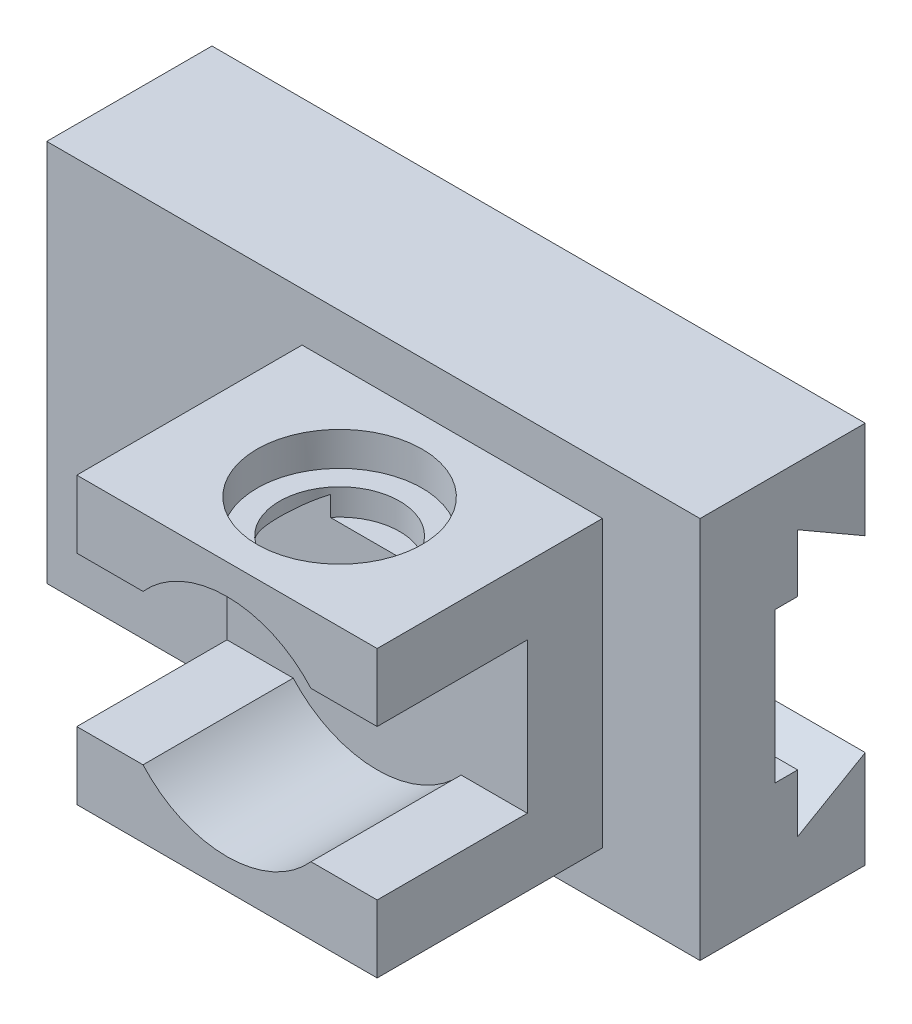
ISO-10303-21;
HEADER;
FILE_DESCRIPTION(('STEP AP214'),'2;1');
FILE_NAME('part.step','',(''),(''),'','','');
FILE_SCHEMA(('AUTOMOTIVE_DESIGN { 1 0 10303 214 1 1 1 1 }'));
ENDSEC;
DATA;
#1=APPLICATION_CONTEXT('core data for automotive mechanical design processes');
#2=APPLICATION_PROTOCOL_DEFINITION('international standard','automotive_design',2000,#1);
#3=PRODUCT_CONTEXT('',#1,'mechanical');
#4=PRODUCT('Part','Part','',(#3));
#5=PRODUCT_RELATED_PRODUCT_CATEGORY('part','',(#4));
#6=PRODUCT_DEFINITION_FORMATION('','',#4);
#7=PRODUCT_DEFINITION_CONTEXT('part definition',#1,'design');
#8=PRODUCT_DEFINITION('design','',#6,#7);
#9=PRODUCT_DEFINITION_SHAPE('','',#8);
#10=(LENGTH_UNIT() NAMED_UNIT(*) SI_UNIT(.MILLI.,.METRE.));
#11=(NAMED_UNIT(*) PLANE_ANGLE_UNIT() SI_UNIT($,.RADIAN.));
#12=(NAMED_UNIT(*) SI_UNIT($,.STERADIAN.) SOLID_ANGLE_UNIT());
#13=UNCERTAINTY_MEASURE_WITH_UNIT(LENGTH_MEASURE(1.E-05),#10,'distance_accuracy_value','');
#14=(GEOMETRIC_REPRESENTATION_CONTEXT(3) GLOBAL_UNCERTAINTY_ASSIGNED_CONTEXT((#13)) GLOBAL_UNIT_ASSIGNED_CONTEXT((#10,
#11,#12)) REPRESENTATION_CONTEXT('',''));
#15=CARTESIAN_POINT('',(0.,0.,0.));
#16=DIRECTION('',(0.,0.,1.));
#17=DIRECTION('',(1.,0.,0.));
#18=AXIS2_PLACEMENT_3D('',#15,#16,#17);
#19=CARTESIAN_POINT('',(10.5,0.,10.));
#20=DIRECTION('',(0.,0.,1.));
#21=DIRECTION('',(1.,0.,0.));
#22=AXIS2_PLACEMENT_3D('',#19,#20,#21);
#23=CYLINDRICAL_SURFACE('',#22,15.);
#24=CARTESIAN_POINT('',(16.7449979983984,13.6381816969859,10.));
#25=CARTESIAN_POINT('',(16.8774714512476,13.5775262840609,10.1654623155525));
#26=CARTESIAN_POINT('',(17.0034994114286,13.5174769282133,10.3363471411134));
#27=CARTESIAN_POINT('',(17.2420257509709,13.4001021446953,10.6883499001585));
#28=CARTESIAN_POINT('',(17.3545161030383,13.3427783452442,10.8694738124033));
#29=CARTESIAN_POINT('',(17.5658322798463,13.2320951561062,11.2423132980955));
#30=CARTESIAN_POINT('',(17.6645678248419,13.1787629330152,11.4340882605258));
#31=CARTESIAN_POINT('',(17.8467168548122,13.078095541513,11.826281412218));
#32=CARTESIAN_POINT('',(17.9301324230849,13.0307595579709,12.0266984217012));
#33=CARTESIAN_POINT('',(18.0811915731914,12.943461357436,12.4361404874427));
#34=CARTESIAN_POINT('',(18.1487554493286,12.9035366069429,12.6452030792369));
#35=CARTESIAN_POINT('',(18.2667056911946,12.8328881221456,13.0695247177853));
#36=CARTESIAN_POINT('',(18.3171021363047,12.8021589901814,13.2847800478509));
#37=CARTESIAN_POINT('',(18.3999055594579,12.7512296120697,13.7192777671675));
#38=CARTESIAN_POINT('',(18.4323668244213,12.7309976042648,13.9385060270799));
#39=CARTESIAN_POINT('',(18.478992543523,12.7018284890676,14.3796369431107));
#40=CARTESIAN_POINT('',(18.4931593922645,12.6928899034535,14.6015392453781));
#41=CARTESIAN_POINT('',(18.5024572952384,12.6870283533692,15.023288483797));
#42=CARTESIAN_POINT('',(18.4993779994731,12.6889757021485,15.2230830025567));
#43=CARTESIAN_POINT('',(18.4783119646579,12.7022318984347,15.6215609525505));
#44=CARTESIAN_POINT('',(18.4603262012561,12.7135401332593,15.8202444556455));
#45=CARTESIAN_POINT('',(18.4096771077578,12.7451125208177,16.2151903915469));
#46=CARTESIAN_POINT('',(18.3770000103122,12.765385073781,16.4114503755995));
#47=CARTESIAN_POINT('',(18.2973915605151,12.8141663079342,16.8000055068291));
#48=CARTESIAN_POINT('',(18.2504598347947,12.8426752048561,16.9923005500124));
#49=CARTESIAN_POINT('',(18.1443443927665,12.9061112921954,17.3666020020042));
#50=CARTESIAN_POINT('',(18.0855278780556,12.9408432298992,17.5487460025875));
#51=CARTESIAN_POINT('',(17.955463718364,13.0162092182344,17.9073122645358));
#52=CARTESIAN_POINT('',(17.8842118572569,13.0568452698334,18.0837325611795));
#53=CARTESIAN_POINT('',(17.6527030563478,13.1859812289927,18.6031132278792));
#54=CARTESIAN_POINT('',(17.4746147365897,13.2817577591637,18.9364657163769));
#55=CARTESIAN_POINT('',(17.0481841059047,13.4976142318033,19.6155219772869));
#56=CARTESIAN_POINT('',(16.7936050043903,13.6192297359874,19.9568242572672));
#57=CARTESIAN_POINT('',(16.3741654919545,13.8028118865487,20.4350028497329));
#58=CARTESIAN_POINT('',(16.227971408317,13.8642438397976,20.5888653937904));
#59=CARTESIAN_POINT('',(15.9235507319899,13.9861341458824,20.8847370896126));
#60=CARTESIAN_POINT('',(15.7653223086274,14.0465923488889,21.0267444310348));
#61=CARTESIAN_POINT('',(15.4213134643418,14.1710040925913,21.3115251163415));
#62=CARTESIAN_POINT('',(15.2343557146027,14.2347121978063,21.4529859568212));
#63=CARTESIAN_POINT('',(14.8477744701627,14.357505472762,21.7195199294077));
#64=CARTESIAN_POINT('',(14.6481560571656,14.4165924763079,21.8445995755402));
#65=CARTESIAN_POINT('',(14.23734100209,14.5285096332329,22.0772873706465));
#66=CARTESIAN_POINT('',(14.0261462599522,14.5813408088654,22.1848983752079));
#67=CARTESIAN_POINT('',(13.5935267379115,14.6792116364636,22.3814988940173));
#68=CARTESIAN_POINT('',(13.3721030265522,14.7242520999451,22.4704903479644));
#69=CARTESIAN_POINT('',(12.9342614498576,14.80273023181,22.6239689901294));
#70=CARTESIAN_POINT('',(12.7183434187811,14.836702799418,22.6896080219648));
#71=CARTESIAN_POINT('',(12.280555629363,14.8955827905569,22.8026095857088));
#72=CARTESIAN_POINT('',(12.0586860584143,14.9204904991491,22.8499726923405));
#73=CARTESIAN_POINT('',(11.6110140423848,14.9604850788364,22.9257270201725));
#74=CARTESIAN_POINT('',(11.385214487131,14.975578877089,22.9541316236259));
#75=CARTESIAN_POINT('',(10.9315729803982,14.9955083699371,22.9915910244065));
#76=CARTESIAN_POINT('',(10.7037312247295,15.0003450376609,23.0006476573411));
#77=CARTESIAN_POINT('',(10.2726204562105,14.9996555105958,22.9993534469689));
#78=CARTESIAN_POINT('',(10.0693404348385,14.9951864990034,22.9909825034523));
#79=CARTESIAN_POINT('',(9.66434851036885,14.97807585785,22.9588280381387));
#80=CARTESIAN_POINT('',(9.46263659133844,14.9654343114358,22.9350446731469));
#81=CARTESIAN_POINT('',(9.06225092817847,14.9322883145487,22.872352905589));
#82=CARTESIAN_POINT('',(8.86357704394651,14.9117842278097,22.8334452026985));
#83=CARTESIAN_POINT('',(8.47059664926903,14.8634020434603,22.7409478027667));
#84=CARTESIAN_POINT('',(8.27629026156228,14.8355237388942,22.6873576936658));
#85=CARTESIAN_POINT('',(7.89471900059612,14.7732731054287,22.566522165247));
#86=CARTESIAN_POINT('',(7.70741175286837,14.7389518804304,22.499383912532));
#87=CARTESIAN_POINT('',(7.33926424082633,14.6644141392276,22.3518090794345));
#88=CARTESIAN_POINT('',(7.15842612222494,14.6241956891468,22.271368135592));
#89=CARTESIAN_POINT('',(6.80418170891273,14.5387107413484,22.0978737187554));
#90=CARTESIAN_POINT('',(6.63077427425694,14.4934450218007,22.0048221895409));
#91=CARTESIAN_POINT('',(6.29208518371996,14.3987650131858,21.8067599316582));
#92=CARTESIAN_POINT('',(6.126806490161,14.3493492292328,21.7017448887405));
#93=CARTESIAN_POINT('',(5.61364505326899,14.1866053364646,21.3487171076231));
#94=CARTESIAN_POINT('',(5.28223431567012,14.0671278424321,21.0791067123665));
#95=CARTESIAN_POINT('',(4.66702010148789,13.8233906646927,20.4915900021837));
#96=CARTESIAN_POINT('',(4.38326023447734,13.6991267269467,20.1736399488162));
#97=CARTESIAN_POINT('',(3.98542158035495,13.5123827164657,19.6491362893218));
#98=CARTESIAN_POINT('',(3.85270198666078,13.4474115183028,19.4573554785567));
#99=CARTESIAN_POINT('',(3.60393079214032,13.3215481982634,19.0618700909064));
#100=CARTESIAN_POINT('',(3.48788265325619,13.260656925008,18.8581630497833));
#101=CARTESIAN_POINT('',(3.27354627803793,13.1450828660525,18.4399938355484));
#102=CARTESIAN_POINT('',(3.17525307882874,13.0903983470288,18.2255346893531));
#103=CARTESIAN_POINT('',(2.99750024364619,12.9893400713051,17.7871815029875));
#104=CARTESIAN_POINT('',(2.91802906566669,12.9429612256929,17.5632933445982));
#105=CARTESIAN_POINT('',(2.78268785855855,12.8626962041667,17.1198789538185));
#106=CARTESIAN_POINT('',(2.72577572961832,12.8282709758953,16.9007692120775));
#107=CARTESIAN_POINT('',(2.63055244167467,12.7700791998823,16.4571366408633));
#108=CARTESIAN_POINT('',(2.59224049422645,12.7463122003513,16.2326140412599));
#109=CARTESIAN_POINT('',(2.53490548255786,12.7105631998255,15.7804694753223));
#110=CARTESIAN_POINT('',(2.51585806627484,12.698566320939,15.5528517914452));
#111=CARTESIAN_POINT('',(2.49732492303083,12.6868956981418,15.0965185739746));
#112=CARTESIAN_POINT('',(2.49783656566545,12.6872202971744,14.8678031921417));
#113=CARTESIAN_POINT('',(2.5169211174683,12.6992335708035,14.4443791521489));
#114=CARTESIAN_POINT('',(2.53289206730412,12.7092850480731,14.2494996536962));
#115=CARTESIAN_POINT('',(2.57894263218259,12.7380370785026,13.8620609420188));
#116=CARTESIAN_POINT('',(2.60902231838089,12.7567376752832,13.6695017405013));
#117=CARTESIAN_POINT('',(2.68294155572153,12.8021668603647,13.2878676409783));
#118=CARTESIAN_POINT('',(2.72679091879086,12.8289011727034,13.0987953296763));
#119=CARTESIAN_POINT('',(2.82772622693689,12.8895175073084,12.7254341544665));
#120=CARTESIAN_POINT('',(2.88481264286266,12.9233997838278,12.5411454609739));
#121=CARTESIAN_POINT('',(3.0768341310381,13.0352927994962,11.9919840210433));
#122=CARTESIAN_POINT('',(3.23155541979662,13.1229168035642,11.6357931441353));
#123=CARTESIAN_POINT('',(3.58815603759052,13.3141673314403,10.9534432955319));
#124=CARTESIAN_POINT('',(3.78997292640729,13.4177726058601,10.6272453500428));
#125=CARTESIAN_POINT('',(4.09119340040101,13.5622547453277,10.209909153143));
#126=CARTESIAN_POINT('',(4.17183994057905,13.6001057274562,10.1038693448976));
#127=CARTESIAN_POINT('',(4.25500200160159,13.6381816969859,9.99999999999999));
#128=B_SPLINE_CURVE_WITH_KNOTS('',3,(#24,#25,#26,#27,#28,#29,#30,#31,#32,#33,#34,#35,#36,#37,
#38,#39,#40,#41,#42,#43,#44,#45,#46,#47,#48,#49,#50,#51,#52,#53,#54,#55,#56,#57,#58,#59,#60,#61,
#62,#63,#64,#65,#66,#67,#68,#69,#70,#71,#72,#73,#74,#75,#76,#77,#78,#79,#80,#81,#82,#83,#84,#85,
#86,#87,#88,#89,#90,#91,#92,#93,#94,#95,#96,#97,#98,#99,#100,#101,#102,#103,#104,#105,#106,#107,
#108,#109,#110,#111,#112,#113,#114,#115,#116,#117,#118,#119,#120,#121,#122,#123,#124,#125,#126,
#127),.UNSPECIFIED.,.F.,.F.,(4,2,2,2,2,2,2,2,2,2,2,2,2,2,2,2,2,2,2,2,2,2,2,2,2,2,2,2,2,2,2,2,2,
2,2,2,2,2,2,2,2,2,2,2,2,2,2,2,2,2,2,4),(0.,0.661288633942855,1.32296747511806,1.98880297920321,
2.65454787202415,3.32357177375558,3.99220219690002,4.6587975376998,5.32530561727309,
5.92402009373679,6.52269538664154,7.12193287540052,7.72118606123525,8.30417091503539,
8.88735381154979,10.052865900678,11.3756255290342,12.0379620345331,12.7003994974637,
13.428334019355,14.1559781915069,14.8835032960918,15.6109525726832,16.2946518315139,
16.9783295882963,17.6615242451255,18.3446540820908,18.9544156599768,19.5641710342865,
20.1738982037158,20.7836424868009,21.3887404568704,21.9940373022662,22.5992409538705,
23.2046635473668,24.529732906723,25.8560084234208,26.5815624174035,27.3072668605465,
28.0327681392337,28.7578233687151,29.4437557479004,30.1296590484961,30.8146942191989,
31.4996372631189,32.0863048343169,32.6729753643314,33.2600648933497,33.8471753086619,
35.0365564624934,36.2243695830939,36.6396732299901),.UNSPECIFIED.);
#129=CARTESIAN_POINT('',(16.7449979983984,13.6381816969859,10.));
#130=VERTEX_POINT('',#129);
#131=CARTESIAN_POINT('',(14.3405728739343,14.5,22.0178344238091));
#132=VERTEX_POINT('',#131);
#133=EDGE_CURVE('E351',#130,#132,#128,.T.);
#134=ORIENTED_EDGE('',*,*,#133,.F.);
#135=CARTESIAN_POINT('',(10.5,0.,10.));
#136=DIRECTION('',(0.,0.,1.));
#137=DIRECTION('',(1.,0.,0.));
#138=AXIS2_PLACEMENT_3D('',#135,#136,#137);
#139=CIRCLE('',#138,15.);
#140=CARTESIAN_POINT('',(21.680339887499,9.99999999999999,10.));
#141=VERTEX_POINT('',#140);
#142=EDGE_CURVE('E269',#141,#130,#139,.T.);
#143=ORIENTED_EDGE('',*,*,#142,.F.);
#144=DIRECTION('',(0.,0.,1.));
#145=VECTOR('',#144,1.);
#146=CARTESIAN_POINT('',(21.680339887499,9.99999999999999,10.));
#147=LINE('',#146,#145);
#148=CARTESIAN_POINT('',(21.680339887499,9.99999999999999,30.));
#149=VERTEX_POINT('',#148);
#150=EDGE_CURVE('E272',#141,#149,#147,.T.);
#151=ORIENTED_EDGE('',*,*,#150,.T.);
#152=CARTESIAN_POINT('',(10.5,0.,30.));
#153=DIRECTION('',(0.,0.,1.));
#154=DIRECTION('',(1.,0.,0.));
#155=AXIS2_PLACEMENT_3D('',#152,#153,#154);
#156=CIRCLE('',#155,15.);
#157=CARTESIAN_POINT('',(-0.680339887498955,9.99999999999999,30.));
#158=VERTEX_POINT('',#157);
#159=EDGE_CURVE('E92',#149,#158,#156,.T.);
#160=ORIENTED_EDGE('',*,*,#159,.T.);
#161=DIRECTION('',(0.,0.,1.));
#162=VECTOR('',#161,1.);
#163=CARTESIAN_POINT('',(-0.680339887498955,9.99999999999999,10.));
#164=LINE('',#163,#162);
#165=CARTESIAN_POINT('',(-0.680339887498955,9.99999999999999,10.));
#166=VERTEX_POINT('',#165);
#167=EDGE_CURVE('E275',#166,#158,#164,.T.);
#168=ORIENTED_EDGE('',*,*,#167,.F.);
#169=CARTESIAN_POINT('',(4.25500200160161,13.6381816969859,10.));
#170=VERTEX_POINT('',#169);
#171=EDGE_CURVE('E273',#170,#166,#139,.T.);
#172=ORIENTED_EDGE('',*,*,#171,.F.);
#173=CARTESIAN_POINT('',(6.65942712606569,14.5,22.0178344238091));
#174=VERTEX_POINT('',#173);
#175=EDGE_CURVE('E263',#174,#170,#128,.T.);
#176=ORIENTED_EDGE('',*,*,#175,.F.);
#177=DIRECTION('',(0.,0.,1.));
#178=VECTOR('',#177,1.);
#179=CARTESIAN_POINT('',(6.65942712606569,14.5,10.));
#180=LINE('',#179,#178);
#181=CARTESIAN_POINT('',(6.65942712606569,14.5,25.3077640640442));
#182=VERTEX_POINT('',#181);
#183=EDGE_CURVE('E650',#182,#174,#180,.F.);
#184=ORIENTED_EDGE('',*,*,#183,.F.);
#185=CARTESIAN_POINT('',(6.65942712606569,14.5,25.3077640640442));
#186=CARTESIAN_POINT('',(6.89346182217872,14.5620248544935,25.3949961900935));
#187=CARTESIAN_POINT('',(7.13171441338095,14.6190303420887,25.4746563770046));
#188=CARTESIAN_POINT('',(7.61540116176376,14.7220915883254,25.618030417892));
#189=CARTESIAN_POINT('',(7.86083870322402,14.7681420905902,25.6817366176605));
#190=CARTESIAN_POINT('',(8.3571323463707,14.8482756377718,25.7922522787512));
#191=CARTESIAN_POINT('',(8.60798197663261,14.882372216712,25.8390808503241));
#192=CARTESIAN_POINT('',(9.11365520394735,14.9379620744572,25.9152827862755));
#193=CARTESIAN_POINT('',(9.36847799389024,14.9594578796112,25.9446596495907));
#194=CARTESIAN_POINT('',(9.88120929739259,14.9894386976786,25.9856026879182));
#195=CARTESIAN_POINT('',(10.1391254318008,14.9978784868101,25.9971069559355));
#196=CARTESIAN_POINT('',(10.6552179824082,15.0014165943867,26.0019317814438));
#197=CARTESIAN_POINT('',(10.9133943981254,14.9965149374952,25.9952523725495));
#198=CARTESIAN_POINT('',(11.4278546009332,14.9734875844974,25.9638243650624));
#199=CARTESIAN_POINT('',(11.6841396709055,14.9553718851444,25.9390894259187));
#200=CARTESIAN_POINT('',(12.193041050254,14.9063399058101,25.8719589461335));
#201=CARTESIAN_POINT('',(12.4456584002585,14.87542733312,25.8295685203157));
#202=CARTESIAN_POINT('',(12.9781652830678,14.7966276884895,25.7210897592694));
#203=CARTESIAN_POINT('',(13.2573311769066,14.7470564031055,25.6526371634867));
#204=CARTESIAN_POINT('',(13.669117955646,14.6620717399656,25.5345661602865));
#205=CARTESIAN_POINT('',(13.8051384371809,14.6319939655395,25.4926742617254));
#206=CARTESIAN_POINT('',(14.0747308933053,14.5684751744832,25.403913928659));
#207=CARTESIAN_POINT('',(14.2083031590305,14.5350345608619,25.3570460904421));
#208=CARTESIAN_POINT('',(14.3405728739343,14.5,25.3077640640442));
#209=B_SPLINE_CURVE_WITH_KNOTS('',3,(#185,#186,#187,#188,#189,#190,#191,#192,#193,#194,#195,
#196,#197,#198,#199,#200,#201,#202,#203,#204,#205,#206,#207,#208),.UNSPECIFIED.,.F.,.F.,(4,2,2,
2,2,2,2,2,2,2,2,4),(0.,0.771944732071215,1.54425911182082,2.31569624531356,3.08697865920326,
3.86092672705627,4.6348733641715,5.40823509778639,6.18137294289177,7.05501447076131,
7.49129947646032,7.92753225912881),.UNSPECIFIED.);
#210=CARTESIAN_POINT('',(14.3405728739343,14.5,25.3077640640442));
#211=VERTEX_POINT('',#210);
#212=EDGE_CURVE('E283',#182,#211,#209,.T.);
#213=ORIENTED_EDGE('',*,*,#212,.T.);
#214=DIRECTION('',(0.,0.,1.));
#215=VECTOR('',#214,1.);
#216=CARTESIAN_POINT('',(14.3405728739343,14.5,10.));
#217=LINE('',#216,#215);
#218=EDGE_CURVE('E258',#132,#211,#217,.T.);
#219=ORIENTED_EDGE('',*,*,#218,.F.);
#220=EDGE_LOOP('',(#134,#143,#151,#160,#168,#172,#176,#184,#213,#219));
#221=FACE_BOUND('',#220,.T.);
#222=ADVANCED_FACE('F70',(#221),#23,.F.);
#223=CARTESIAN_POINT('',(0.,0.,10.));
#224=DIRECTION('',(0.,0.,1.));
#225=DIRECTION('',(1.,0.,0.));
#226=AXIS2_PLACEMENT_3D('',#223,#224,#225);
#227=PLANE('',#226);
#228=ORIENTED_EDGE('',*,*,#142,.T.);
#229=DIRECTION('',(0.,1.,0.));
#230=VECTOR('',#229,1.);
#231=CARTESIAN_POINT('',(16.7449979983984,11.,10.));
#232=LINE('',#231,#230);
#233=CARTESIAN_POINT('',(16.7449979983984,11.,10.));
#234=VERTEX_POINT('',#233);
#235=EDGE_CURVE('E12',#130,#234,#232,.F.);
#236=ORIENTED_EDGE('',*,*,#235,.T.);
#237=DIRECTION('',(-1.,0.,0.));
#238=VECTOR('',#237,1.);
#239=CARTESIAN_POINT('',(0.,11.,10.));
#240=LINE('',#239,#238);
#241=CARTESIAN_POINT('',(4.25500200160161,11.,10.));
#242=VERTEX_POINT('',#241);
#243=EDGE_CURVE('E254',#234,#242,#240,.T.);
#244=ORIENTED_EDGE('',*,*,#243,.T.);
#245=DIRECTION('',(0.,1.,0.));
#246=VECTOR('',#245,1.);
#247=CARTESIAN_POINT('',(4.25500200160161,11.,10.));
#248=LINE('',#247,#246);
#249=EDGE_CURVE('E78',#242,#170,#248,.T.);
#250=ORIENTED_EDGE('',*,*,#249,.T.);
#251=ORIENTED_EDGE('',*,*,#171,.T.);
#252=DIRECTION('',(1.,0.,0.));
#253=VECTOR('',#252,1.);
#254=CARTESIAN_POINT('',(-9.5,9.99999999999999,10.));
#255=LINE('',#254,#253);
#256=CARTESIAN_POINT('',(-9.5,9.99999999999999,10.));
#257=VERTEX_POINT('',#256);
#258=EDGE_CURVE('E295',#257,#166,#255,.T.);
#259=ORIENTED_EDGE('',*,*,#258,.F.);
#260=DIRECTION('',(0.,1.,0.));
#261=VECTOR('',#260,1.);
#262=CARTESIAN_POINT('',(-9.5,-10.,10.));
#263=LINE('',#262,#261);
#264=CARTESIAN_POINT('',(-9.5,-10.,10.));
#265=VERTEX_POINT('',#264);
#266=EDGE_CURVE('E304',#265,#257,#263,.T.);
#267=ORIENTED_EDGE('',*,*,#266,.F.);
#268=DIRECTION('',(1.,0.,0.));
#269=VECTOR('',#268,1.);
#270=CARTESIAN_POINT('',(-9.5,-10.,10.));
#271=LINE('',#270,#269);
#272=CARTESIAN_POINT('',(-0.680339887498943,-10.,10.));
#273=VERTEX_POINT('',#272);
#274=EDGE_CURVE('E301',#265,#273,#271,.T.);
#275=ORIENTED_EDGE('',*,*,#274,.T.);
#276=CARTESIAN_POINT('',(10.5,0.,10.));
#277=DIRECTION('',(0.,0.,1.));
#278=DIRECTION('',(1.,0.,0.));
#279=AXIS2_PLACEMENT_3D('',#276,#277,#278);
#280=CIRCLE('',#279,15.);
#281=CARTESIAN_POINT('',(21.680339887499,-10.,10.));
#282=VERTEX_POINT('',#281);
#283=EDGE_CURVE('E285',#273,#282,#280,.T.);
#284=ORIENTED_EDGE('',*,*,#283,.T.);
#285=CARTESIAN_POINT('',(30.5,-9.99999999999999,10.));
#286=VERTEX_POINT('',#285);
#287=EDGE_CURVE('E300',#282,#286,#271,.T.);
#288=ORIENTED_EDGE('',*,*,#287,.T.);
#289=DIRECTION('',(0.,1.,0.));
#290=VECTOR('',#289,1.);
#291=CARTESIAN_POINT('',(30.5,-9.99999999999999,10.));
#292=LINE('',#291,#290);
#293=CARTESIAN_POINT('',(30.5,9.99999999999999,10.));
#294=VERTEX_POINT('',#293);
#295=EDGE_CURVE('E298',#286,#294,#292,.T.);
#296=ORIENTED_EDGE('',*,*,#295,.T.);
#297=EDGE_CURVE('E271',#141,#294,#255,.T.);
#298=ORIENTED_EDGE('',*,*,#297,.F.);
#299=EDGE_LOOP('',(#228,#236,#244,#250,#251,#259,#267,#275,#284,#288,#296,#298));
#300=FACE_BOUND('',#299,.T.);
#301=ADVANCED_FACE('F266',(#300),#227,.T.);
#302=CARTESIAN_POINT('',(30.5,-19.,30.));
#303=DIRECTION('',(-1.,0.,0.));
#304=DIRECTION('',(0.,0.,1.));
#305=AXIS2_PLACEMENT_3D('',#302,#303,#304);
#306=PLANE('',#305);
#307=DIRECTION('',(0.,0.,1.));
#308=VECTOR('',#307,1.);
#309=CARTESIAN_POINT('',(30.5,9.99999999999999,10.));
#310=LINE('',#309,#308);
#311=CARTESIAN_POINT('',(30.5,9.99999999999999,30.));
#312=VERTEX_POINT('',#311);
#313=EDGE_CURVE('E292',#294,#312,#310,.T.);
#314=ORIENTED_EDGE('',*,*,#313,.F.);
#315=ORIENTED_EDGE('',*,*,#295,.F.);
#316=DIRECTION('',(0.,0.,1.));
#317=VECTOR('',#316,1.);
#318=CARTESIAN_POINT('',(30.5,-9.99999999999999,10.));
#319=LINE('',#318,#317);
#320=CARTESIAN_POINT('',(30.5,-9.99999999999999,30.));
#321=VERTEX_POINT('',#320);
#322=EDGE_CURVE('E320',#286,#321,#319,.T.);
#323=ORIENTED_EDGE('',*,*,#322,.T.);
#324=DIRECTION('',(0.,1.,0.));
#325=VECTOR('',#324,1.);
#326=CARTESIAN_POINT('',(30.5,-19.,30.));
#327=LINE('',#326,#325);
#328=CARTESIAN_POINT('',(30.5,-19.,30.));
#329=VERTEX_POINT('',#328);
#330=EDGE_CURVE('E678',#329,#321,#327,.T.);
#331=ORIENTED_EDGE('',*,*,#330,.F.);
#332=DIRECTION('',(0.,0.,-1.));
#333=VECTOR('',#332,1.);
#334=CARTESIAN_POINT('',(30.5,-19.,30.));
#335=LINE('',#334,#333);
#336=CARTESIAN_POINT('',(30.5,-19.,0.));
#337=VERTEX_POINT('',#336);
#338=EDGE_CURVE('E697',#329,#337,#335,.T.);
#339=ORIENTED_EDGE('',*,*,#338,.T.);
#340=DIRECTION('',(0.,1.,0.));
#341=VECTOR('',#340,1.);
#342=CARTESIAN_POINT('',(30.5,-19.,0.));
#343=LINE('',#342,#341);
#344=CARTESIAN_POINT('',(30.5,19.,0.));
#345=VERTEX_POINT('',#344);
#346=EDGE_CURVE('E692',#337,#345,#343,.T.);
#347=ORIENTED_EDGE('',*,*,#346,.T.);
#348=DIRECTION('',(0.,0.,-1.));
#349=VECTOR('',#348,1.);
#350=CARTESIAN_POINT('',(30.5,19.,30.));
#351=LINE('',#350,#349);
#352=CARTESIAN_POINT('',(30.5,19.,30.));
#353=VERTEX_POINT('',#352);
#354=EDGE_CURVE('E681',#353,#345,#351,.T.);
#355=ORIENTED_EDGE('',*,*,#354,.F.);
#356=EDGE_CURVE('E641',#312,#353,#327,.T.);
#357=ORIENTED_EDGE('',*,*,#356,.F.);
#358=EDGE_LOOP('',(#314,#315,#323,#331,#339,#347,#355,#357));
#359=FACE_BOUND('',#358,.T.);
#360=ADVANCED_FACE('F559',(#359),#306,.F.);
#361=CARTESIAN_POINT('',(0.,0.,30.));
#362=DIRECTION('',(0.,0.,1.));
#363=DIRECTION('',(1.,0.,0.));
#364=AXIS2_PLACEMENT_3D('',#361,#362,#363);
#365=PLANE('',#364);
#366=ORIENTED_EDGE('',*,*,#159,.F.);
#367=DIRECTION('',(1.,0.,0.));
#368=VECTOR('',#367,1.);
#369=CARTESIAN_POINT('',(-9.5,9.99999999999999,30.));
#370=LINE('',#369,#368);
#371=EDGE_CURVE('E312',#149,#312,#370,.T.);
#372=ORIENTED_EDGE('',*,*,#371,.T.);
#373=ORIENTED_EDGE('',*,*,#356,.T.);
#374=DIRECTION('',(-1.,0.,0.));
#375=VECTOR('',#374,1.);
#376=CARTESIAN_POINT('',(30.5,19.,30.));
#377=LINE('',#376,#375);
#378=CARTESIAN_POINT('',(-9.5,19.,30.));
#379=VERTEX_POINT('',#378);
#380=EDGE_CURVE('E669',#353,#379,#377,.T.);
#381=ORIENTED_EDGE('',*,*,#380,.T.);
#382=DIRECTION('',(0.,-1.,0.));
#383=VECTOR('',#382,1.);
#384=CARTESIAN_POINT('',(-9.5,19.,30.));
#385=LINE('',#384,#383);
#386=CARTESIAN_POINT('',(-9.5,9.99999999999999,30.));
#387=VERTEX_POINT('',#386);
#388=EDGE_CURVE('E666',#379,#387,#385,.T.);
#389=ORIENTED_EDGE('',*,*,#388,.T.);
#390=EDGE_CURVE('E308',#387,#158,#370,.T.);
#391=ORIENTED_EDGE('',*,*,#390,.T.);
#392=EDGE_LOOP('',(#366,#372,#373,#381,#389,#391));
#393=FACE_BOUND('',#392,.T.);
#394=ADVANCED_FACE('F479',(#393),#365,.T.);
#395=CARTESIAN_POINT('',(0.,0.,-22.));
#396=DIRECTION('',(0.,0.,1.));
#397=DIRECTION('',(1.,0.,0.));
#398=AXIS2_PLACEMENT_3D('',#395,#396,#397);
#399=PLANE('',#398);
#400=DIRECTION('',(0.,-1.,0.));
#401=VECTOR('',#400,1.);
#402=CARTESIAN_POINT('',(-43.5,25.491,-22.));
#403=LINE('',#402,#401);
#404=CARTESIAN_POINT('',(-43.5,-12.5,-22.));
#405=VERTEX_POINT('',#404);
#406=CARTESIAN_POINT('',(-43.5,-25.491,-22.));
#407=VERTEX_POINT('',#406);
#408=EDGE_CURVE('E709',#405,#407,#403,.T.);
#409=ORIENTED_EDGE('',*,*,#408,.F.);
#410=DIRECTION('',(-1.,0.,0.));
#411=VECTOR('',#410,1.);
#412=CARTESIAN_POINT('',(43.5,-12.5,-22.));
#413=LINE('',#412,#411);
#414=CARTESIAN_POINT('',(43.5,-12.5,-22.));
#415=VERTEX_POINT('',#414);
#416=EDGE_CURVE('E778',#415,#405,#413,.T.);
#417=ORIENTED_EDGE('',*,*,#416,.F.);
#418=DIRECTION('',(0.,1.,0.));
#419=VECTOR('',#418,1.);
#420=CARTESIAN_POINT('',(43.5,-25.491,-22.));
#421=LINE('',#420,#419);
#422=CARTESIAN_POINT('',(43.5,-25.491,-22.));
#423=VERTEX_POINT('',#422);
#424=EDGE_CURVE('E718',#423,#415,#421,.T.);
#425=ORIENTED_EDGE('',*,*,#424,.F.);
#426=DIRECTION('',(1.,0.,0.));
#427=VECTOR('',#426,1.);
#428=CARTESIAN_POINT('',(-43.5,-25.491,-22.));
#429=LINE('',#428,#427);
#430=EDGE_CURVE('E714',#407,#423,#429,.T.);
#431=ORIENTED_EDGE('',*,*,#430,.F.);
#432=EDGE_LOOP('',(#409,#417,#425,#431));
#433=FACE_BOUND('',#432,.T.);
#434=ADVANCED_FACE('F522',(#433),#399,.F.);
#435=CARTESIAN_POINT('',(43.5,25.491,-22.));
#436=DIRECTION('',(0.,1.,0.));
#437=DIRECTION('',(-1.,0.,0.));
#438=AXIS2_PLACEMENT_3D('',#435,#436,#437);
#439=PLANE('',#438);
#440=DIRECTION('',(-1.,0.,0.));
#441=VECTOR('',#440,1.);
#442=CARTESIAN_POINT('',(43.5,25.491,0.));
#443=LINE('',#442,#441);
#444=CARTESIAN_POINT('',(43.5,25.491,0.));
#445=VERTEX_POINT('',#444);
#446=CARTESIAN_POINT('',(-43.5,25.491,0.));
#447=VERTEX_POINT('',#446);
#448=EDGE_CURVE('E705',#445,#447,#443,.T.);
#449=ORIENTED_EDGE('',*,*,#448,.F.);
#450=DIRECTION('',(0.,0.,1.));
#451=VECTOR('',#450,1.);
#452=CARTESIAN_POINT('',(43.5,25.491,-22.));
#453=LINE('',#452,#451);
#454=CARTESIAN_POINT('',(43.5,25.491,-22.));
#455=VERTEX_POINT('',#454);
#456=EDGE_CURVE('E654',#455,#445,#453,.T.);
#457=ORIENTED_EDGE('',*,*,#456,.F.);
#458=DIRECTION('',(-1.,0.,0.));
#459=VECTOR('',#458,1.);
#460=CARTESIAN_POINT('',(43.5,25.491,-22.));
#461=LINE('',#460,#459);
#462=CARTESIAN_POINT('',(-43.5,25.491,-22.));
#463=VERTEX_POINT('',#462);
#464=EDGE_CURVE('E706',#455,#463,#461,.T.);
#465=ORIENTED_EDGE('',*,*,#464,.T.);
#466=DIRECTION('',(0.,0.,1.));
#467=VECTOR('',#466,1.);
#468=CARTESIAN_POINT('',(-43.5,25.491,-22.));
#469=LINE('',#468,#467);
#470=EDGE_CURVE('E660',#463,#447,#469,.T.);
#471=ORIENTED_EDGE('',*,*,#470,.T.);
#472=EDGE_LOOP('',(#449,#457,#465,#471));
#473=FACE_BOUND('',#472,.T.);
#474=ADVANCED_FACE('F72',(#473),#439,.T.);
#475=CARTESIAN_POINT('',(43.5,-25.491,-22.));
#476=DIRECTION('',(1.,0.,0.));
#477=DIRECTION('',(0.,1.,0.));
#478=AXIS2_PLACEMENT_3D('',#475,#476,#477);
#479=PLANE('',#478);
#480=DIRECTION('',(0.,-0.500000000000002,0.866025403784438));
#481=VECTOR('',#480,1.);
#482=CARTESIAN_POINT('',(43.5,-17.6961524227067,-13.));
#483=LINE('',#482,#481);
#484=CARTESIAN_POINT('',(43.5,-17.6961524227067,-13.));
#485=VERTEX_POINT('',#484);
#486=EDGE_CURVE('E804',#415,#485,#483,.T.);
#487=ORIENTED_EDGE('',*,*,#486,.T.);
#488=DIRECTION('',(0.,1.,0.));
#489=VECTOR('',#488,1.);
#490=CARTESIAN_POINT('',(43.5,-10.,-13.));
#491=LINE('',#490,#489);
#492=CARTESIAN_POINT('',(43.5,-10.,-13.));
#493=VERTEX_POINT('',#492);
#494=EDGE_CURVE('E792',#485,#493,#491,.T.);
#495=ORIENTED_EDGE('',*,*,#494,.T.);
#496=DIRECTION('',(0.,0.,1.));
#497=VECTOR('',#496,1.);
#498=CARTESIAN_POINT('',(43.5,-10.,-10.));
#499=LINE('',#498,#497);
#500=CARTESIAN_POINT('',(43.5,-10.,-10.));
#501=VERTEX_POINT('',#500);
#502=EDGE_CURVE('E787',#493,#501,#499,.T.);
#503=ORIENTED_EDGE('',*,*,#502,.T.);
#504=DIRECTION('',(0.,1.,0.));
#505=VECTOR('',#504,1.);
#506=CARTESIAN_POINT('',(43.5,10.,-10.));
#507=LINE('',#506,#505);
#508=CARTESIAN_POINT('',(43.5,10.,-10.));
#509=VERTEX_POINT('',#508);
#510=EDGE_CURVE('E783',#501,#509,#507,.T.);
#511=ORIENTED_EDGE('',*,*,#510,.T.);
#512=DIRECTION('',(0.,0.,-1.));
#513=VECTOR('',#512,1.);
#514=CARTESIAN_POINT('',(43.5,10.,-10.));
#515=LINE('',#514,#513);
#516=CARTESIAN_POINT('',(43.5,10.,-13.));
#517=VERTEX_POINT('',#516);
#518=EDGE_CURVE('E770',#509,#517,#515,.T.);
#519=ORIENTED_EDGE('',*,*,#518,.T.);
#520=DIRECTION('',(0.,1.,0.));
#521=VECTOR('',#520,1.);
#522=CARTESIAN_POINT('',(43.5,10.,-13.));
#523=LINE('',#522,#521);
#524=CARTESIAN_POINT('',(43.5,17.6961524227067,-13.));
#525=VERTEX_POINT('',#524);
#526=EDGE_CURVE('E799',#517,#525,#523,.T.);
#527=ORIENTED_EDGE('',*,*,#526,.T.);
#528=DIRECTION('',(0.,-0.500000000000002,-0.866025403784438));
#529=VECTOR('',#528,1.);
#530=CARTESIAN_POINT('',(43.5,17.6961524227067,-13.));
#531=LINE('',#530,#529);
#532=CARTESIAN_POINT('',(43.5,12.5,-22.));
#533=VERTEX_POINT('',#532);
#534=EDGE_CURVE('E802',#525,#533,#531,.T.);
#535=ORIENTED_EDGE('',*,*,#534,.T.);
#536=EDGE_CURVE('E717',#533,#455,#421,.T.);
#537=ORIENTED_EDGE('',*,*,#536,.T.);
#538=ORIENTED_EDGE('',*,*,#456,.T.);
#539=DIRECTION('',(0.,1.,0.));
#540=VECTOR('',#539,1.);
#541=CARTESIAN_POINT('',(43.5,-25.491,0.));
#542=LINE('',#541,#540);
#543=CARTESIAN_POINT('',(43.5,-25.491,0.));
#544=VERTEX_POINT('',#543);
#545=EDGE_CURVE('E710',#544,#445,#542,.T.);
#546=ORIENTED_EDGE('',*,*,#545,.F.);
#547=DIRECTION('',(0.,0.,1.));
#548=VECTOR('',#547,1.);
#549=CARTESIAN_POINT('',(43.5,-25.491,-22.));
#550=LINE('',#549,#548);
#551=EDGE_CURVE('E657',#423,#544,#550,.T.);
#552=ORIENTED_EDGE('',*,*,#551,.F.);
#553=ORIENTED_EDGE('',*,*,#424,.T.);
#554=EDGE_LOOP('',(#487,#495,#503,#511,#519,#527,#535,#537,#538,#546,#552,#553));
#555=FACE_BOUND('',#554,.T.);
#556=ADVANCED_FACE('F535',(#555),#479,.T.);
#557=CARTESIAN_POINT('',(-43.5,-25.491,-22.));
#558=DIRECTION('',(0.,-1.,0.));
#559=DIRECTION('',(1.,0.,0.));
#560=AXIS2_PLACEMENT_3D('',#557,#558,#559);
#561=PLANE('',#560);
#562=DIRECTION('',(1.,0.,0.));
#563=VECTOR('',#562,1.);
#564=CARTESIAN_POINT('',(-43.5,-25.491,0.));
#565=LINE('',#564,#563);
#566=CARTESIAN_POINT('',(-43.5,-25.491,0.));
#567=VERTEX_POINT('',#566);
#568=EDGE_CURVE('E726',#567,#544,#565,.T.);
#569=ORIENTED_EDGE('',*,*,#568,.F.);
#570=DIRECTION('',(0.,0.,1.));
#571=VECTOR('',#570,1.);
#572=CARTESIAN_POINT('',(-43.5,-25.491,-22.));
#573=LINE('',#572,#571);
#574=EDGE_CURVE('E731',#407,#567,#573,.T.);
#575=ORIENTED_EDGE('',*,*,#574,.F.);
#576=ORIENTED_EDGE('',*,*,#430,.T.);
#577=ORIENTED_EDGE('',*,*,#551,.T.);
#578=EDGE_LOOP('',(#569,#575,#576,#577));
#579=FACE_BOUND('',#578,.T.);
#580=ADVANCED_FACE('F528',(#579),#561,.T.);
#581=CARTESIAN_POINT('',(-43.5,25.491,-22.));
#582=DIRECTION('',(-1.,0.,0.));
#583=DIRECTION('',(0.,0.,1.));
#584=AXIS2_PLACEMENT_3D('',#581,#582,#583);
#585=PLANE('',#584);
#586=DIRECTION('',(0.,-0.500000000000002,0.866025403784438));
#587=VECTOR('',#586,1.);
#588=CARTESIAN_POINT('',(-43.5,-17.6961524227067,-13.));
#589=LINE('',#588,#587);
#590=CARTESIAN_POINT('',(-43.5,-17.6961524227067,-13.));
#591=VERTEX_POINT('',#590);
#592=EDGE_CURVE('E753',#405,#591,#589,.T.);
#593=ORIENTED_EDGE('',*,*,#592,.F.);
#594=ORIENTED_EDGE('',*,*,#408,.T.);
#595=ORIENTED_EDGE('',*,*,#574,.T.);
#596=DIRECTION('',(0.,-1.,0.));
#597=VECTOR('',#596,1.);
#598=CARTESIAN_POINT('',(-43.5,25.491,0.));
#599=LINE('',#598,#597);
#600=EDGE_CURVE('E723',#447,#567,#599,.T.);
#601=ORIENTED_EDGE('',*,*,#600,.F.);
#602=ORIENTED_EDGE('',*,*,#470,.F.);
#603=CARTESIAN_POINT('',(-43.5,12.5,-22.));
#604=VERTEX_POINT('',#603);
#605=EDGE_CURVE('E711',#463,#604,#403,.T.);
#606=ORIENTED_EDGE('',*,*,#605,.T.);
#607=DIRECTION('',(0.,-0.500000000000002,-0.866025403784438));
#608=VECTOR('',#607,1.);
#609=CARTESIAN_POINT('',(-43.5,17.6961524227067,-13.));
#610=LINE('',#609,#608);
#611=CARTESIAN_POINT('',(-43.5,17.6961524227067,-13.));
#612=VERTEX_POINT('',#611);
#613=EDGE_CURVE('E749',#612,#604,#610,.T.);
#614=ORIENTED_EDGE('',*,*,#613,.F.);
#615=DIRECTION('',(0.,1.,0.));
#616=VECTOR('',#615,1.);
#617=CARTESIAN_POINT('',(-43.5,10.,-13.));
#618=LINE('',#617,#616);
#619=CARTESIAN_POINT('',(-43.5,10.,-13.));
#620=VERTEX_POINT('',#619);
#621=EDGE_CURVE('E752',#620,#612,#618,.T.);
#622=ORIENTED_EDGE('',*,*,#621,.F.);
#623=DIRECTION('',(0.,0.,-1.));
#624=VECTOR('',#623,1.);
#625=CARTESIAN_POINT('',(-43.5,10.,-10.));
#626=LINE('',#625,#624);
#627=CARTESIAN_POINT('',(-43.5,10.,-10.));
#628=VERTEX_POINT('',#627);
#629=EDGE_CURVE('E758',#628,#620,#626,.T.);
#630=ORIENTED_EDGE('',*,*,#629,.F.);
#631=DIRECTION('',(0.,1.,0.));
#632=VECTOR('',#631,1.);
#633=CARTESIAN_POINT('',(-43.5,10.,-10.));
#634=LINE('',#633,#632);
#635=CARTESIAN_POINT('',(-43.5,-10.,-10.));
#636=VERTEX_POINT('',#635);
#637=EDGE_CURVE('E767',#636,#628,#634,.T.);
#638=ORIENTED_EDGE('',*,*,#637,.F.);
#639=DIRECTION('',(0.,0.,1.));
#640=VECTOR('',#639,1.);
#641=CARTESIAN_POINT('',(-43.5,-10.,-10.));
#642=LINE('',#641,#640);
#643=CARTESIAN_POINT('',(-43.5,-10.,-13.));
#644=VERTEX_POINT('',#643);
#645=EDGE_CURVE('E764',#644,#636,#642,.T.);
#646=ORIENTED_EDGE('',*,*,#645,.F.);
#647=DIRECTION('',(0.,1.,0.));
#648=VECTOR('',#647,1.);
#649=CARTESIAN_POINT('',(-43.5,-10.,-13.));
#650=LINE('',#649,#648);
#651=EDGE_CURVE('E756',#591,#644,#650,.T.);
#652=ORIENTED_EDGE('',*,*,#651,.F.);
#653=EDGE_LOOP('',(#593,#594,#595,#601,#602,#606,#614,#622,#630,#638,#646,#652));
#654=FACE_BOUND('',#653,.T.);
#655=ADVANCED_FACE('F519',(#654),#585,.T.);
#656=ORIENTED_EDGE('',*,*,#536,.F.);
#657=DIRECTION('',(-1.,0.,0.));
#658=VECTOR('',#657,1.);
#659=CARTESIAN_POINT('',(43.5,12.5,-22.));
#660=LINE('',#659,#658);
#661=EDGE_CURVE('E746',#533,#604,#660,.T.);
#662=ORIENTED_EDGE('',*,*,#661,.T.);
#663=ORIENTED_EDGE('',*,*,#605,.F.);
#664=ORIENTED_EDGE('',*,*,#464,.F.);
#665=EDGE_LOOP('',(#656,#662,#663,#664));
#666=FACE_BOUND('',#665,.T.);
#667=ADVANCED_FACE('F511',(#666),#399,.F.);
#668=CARTESIAN_POINT('',(0.,0.,0.));
#669=DIRECTION('',(0.,0.,1.));
#670=DIRECTION('',(1.,0.,0.));
#671=AXIS2_PLACEMENT_3D('',#668,#669,#670);
#672=PLANE('',#671);
#673=DIRECTION('',(-1.,0.,0.));
#674=VECTOR('',#673,1.);
#675=CARTESIAN_POINT('',(30.5,19.,0.));
#676=LINE('',#675,#674);
#677=CARTESIAN_POINT('',(-9.5,19.,0.));
#678=VERTEX_POINT('',#677);
#679=EDGE_CURVE('E682',#345,#678,#676,.T.);
#680=ORIENTED_EDGE('',*,*,#679,.F.);
#681=ORIENTED_EDGE('',*,*,#346,.F.);
#682=DIRECTION('',(1.,0.,0.));
#683=VECTOR('',#682,1.);
#684=CARTESIAN_POINT('',(-9.5,-19.,0.));
#685=LINE('',#684,#683);
#686=CARTESIAN_POINT('',(-9.5,-19.,0.));
#687=VERTEX_POINT('',#686);
#688=EDGE_CURVE('E689',#687,#337,#685,.T.);
#689=ORIENTED_EDGE('',*,*,#688,.F.);
#690=DIRECTION('',(0.,-1.,0.));
#691=VECTOR('',#690,1.);
#692=CARTESIAN_POINT('',(-9.5,19.,0.));
#693=LINE('',#692,#691);
#694=EDGE_CURVE('E685',#678,#687,#693,.T.);
#695=ORIENTED_EDGE('',*,*,#694,.F.);
#696=EDGE_LOOP('',(#680,#681,#689,#695));
#697=FACE_BOUND('',#696,.T.);
#698=ORIENTED_EDGE('',*,*,#448,.T.);
#699=ORIENTED_EDGE('',*,*,#600,.T.);
#700=ORIENTED_EDGE('',*,*,#568,.T.);
#701=ORIENTED_EDGE('',*,*,#545,.T.);
#702=EDGE_LOOP('',(#698,#699,#700,#701));
#703=FACE_BOUND('',#702,.T.);
#704=ADVANCED_FACE('F503',(#697,#703),#672,.T.);
#705=CARTESIAN_POINT('',(30.5,19.,30.));
#706=DIRECTION('',(0.,-1.,0.));
#707=DIRECTION('',(0.,0.,-1.));
#708=AXIS2_PLACEMENT_3D('',#705,#706,#707);
#709=PLANE('',#708);
#710=CARTESIAN_POINT('',(10.5,19.,15.));
#711=DIRECTION('',(0.,-1.,0.));
#712=DIRECTION('',(0.,0.,-1.));
#713=AXIS2_PLACEMENT_3D('',#710,#711,#712);
#714=CIRCLE('',#713,11.);
#715=CARTESIAN_POINT('',(10.5,19.,4.));
#716=VERTEX_POINT('',#715);
#717=EDGE_CURVE('E332',#716,#716,#714,.T.);
#718=ORIENTED_EDGE('',*,*,#717,.T.);
#719=EDGE_LOOP('',(#718));
#720=FACE_BOUND('',#719,.T.);
#721=ORIENTED_EDGE('',*,*,#679,.T.);
#722=DIRECTION('',(0.,0.,-1.));
#723=VECTOR('',#722,1.);
#724=CARTESIAN_POINT('',(-9.5,19.,30.));
#725=LINE('',#724,#723);
#726=EDGE_CURVE('E703',#379,#678,#725,.T.);
#727=ORIENTED_EDGE('',*,*,#726,.F.);
#728=ORIENTED_EDGE('',*,*,#380,.F.);
#729=ORIENTED_EDGE('',*,*,#354,.T.);
#730=EDGE_LOOP('',(#721,#727,#728,#729));
#731=FACE_BOUND('',#730,.T.);
#732=ADVANCED_FACE('F495',(#720,#731),#709,.F.);
#733=CARTESIAN_POINT('',(-9.5,19.,30.));
#734=DIRECTION('',(1.,0.,0.));
#735=DIRECTION('',(0.,0.,-1.));
#736=AXIS2_PLACEMENT_3D('',#733,#734,#735);
#737=PLANE('',#736);
#738=CARTESIAN_POINT('',(-9.5,-10.,30.));
#739=VERTEX_POINT('',#738);
#740=CARTESIAN_POINT('',(-9.5,-19.,30.));
#741=VERTEX_POINT('',#740);
#742=EDGE_CURVE('E672',#739,#741,#385,.T.);
#743=ORIENTED_EDGE('',*,*,#742,.F.);
#744=DIRECTION('',(0.,0.,1.));
#745=VECTOR('',#744,1.);
#746=CARTESIAN_POINT('',(-9.5,-10.,10.));
#747=LINE('',#746,#745);
#748=EDGE_CURVE('E318',#265,#739,#747,.T.);
#749=ORIENTED_EDGE('',*,*,#748,.F.);
#750=ORIENTED_EDGE('',*,*,#266,.T.);
#751=DIRECTION('',(0.,0.,1.));
#752=VECTOR('',#751,1.);
#753=CARTESIAN_POINT('',(-9.5,9.99999999999999,10.));
#754=LINE('',#753,#752);
#755=EDGE_CURVE('E307',#257,#387,#754,.T.);
#756=ORIENTED_EDGE('',*,*,#755,.T.);
#757=ORIENTED_EDGE('',*,*,#388,.F.);
#758=ORIENTED_EDGE('',*,*,#726,.T.);
#759=ORIENTED_EDGE('',*,*,#694,.T.);
#760=DIRECTION('',(0.,0.,-1.));
#761=VECTOR('',#760,1.);
#762=CARTESIAN_POINT('',(-9.5,-19.,30.));
#763=LINE('',#762,#761);
#764=EDGE_CURVE('E700',#741,#687,#763,.T.);
#765=ORIENTED_EDGE('',*,*,#764,.F.);
#766=EDGE_LOOP('',(#743,#749,#750,#756,#757,#758,#759,#765));
#767=FACE_BOUND('',#766,.T.);
#768=ADVANCED_FACE('F486',(#767),#737,.F.);
#769=CARTESIAN_POINT('',(-9.5,-19.,30.));
#770=DIRECTION('',(0.,1.,0.));
#771=DIRECTION('',(0.,0.,1.));
#772=AXIS2_PLACEMENT_3D('',#769,#770,#771);
#773=PLANE('',#772);
#774=ORIENTED_EDGE('',*,*,#688,.T.);
#775=ORIENTED_EDGE('',*,*,#338,.F.);
#776=DIRECTION('',(1.,0.,0.));
#777=VECTOR('',#776,1.);
#778=CARTESIAN_POINT('',(-9.5,-19.,30.));
#779=LINE('',#778,#777);
#780=EDGE_CURVE('E671',#741,#329,#779,.T.);
#781=ORIENTED_EDGE('',*,*,#780,.F.);
#782=ORIENTED_EDGE('',*,*,#764,.T.);
#783=EDGE_LOOP('',(#774,#775,#781,#782));
#784=FACE_BOUND('',#783,.T.);
#785=ADVANCED_FACE('F476',(#784),#773,.F.);
#786=DIRECTION('',(1.,0.,0.));
#787=VECTOR('',#786,1.);
#788=CARTESIAN_POINT('',(-9.5,-10.,30.));
#789=LINE('',#788,#787);
#790=CARTESIAN_POINT('',(21.680339887499,-10.,30.));
#791=VERTEX_POINT('',#790);
#792=EDGE_CURVE('E311',#791,#321,#789,.T.);
#793=ORIENTED_EDGE('',*,*,#792,.F.);
#794=CARTESIAN_POINT('',(10.5,0.,30.));
#795=DIRECTION('',(0.,0.,1.));
#796=DIRECTION('',(1.,0.,0.));
#797=AXIS2_PLACEMENT_3D('',#794,#795,#796);
#798=CIRCLE('',#797,15.);
#799=CARTESIAN_POINT('',(-0.680339887498943,-10.,30.));
#800=VERTEX_POINT('',#799);
#801=EDGE_CURVE('E289',#800,#791,#798,.T.);
#802=ORIENTED_EDGE('',*,*,#801,.F.);
#803=EDGE_CURVE('E313',#739,#800,#789,.T.);
#804=ORIENTED_EDGE('',*,*,#803,.F.);
#805=ORIENTED_EDGE('',*,*,#742,.T.);
#806=ORIENTED_EDGE('',*,*,#780,.T.);
#807=ORIENTED_EDGE('',*,*,#330,.T.);
#808=EDGE_LOOP('',(#793,#802,#804,#805,#806,#807));
#809=FACE_BOUND('',#808,.T.);
#810=ADVANCED_FACE('F468',(#809),#365,.T.);
#811=CARTESIAN_POINT('',(43.5,10.,-10.));
#812=DIRECTION('',(0.,1.,0.));
#813=DIRECTION('',(0.,0.,1.));
#814=AXIS2_PLACEMENT_3D('',#811,#812,#813);
#815=PLANE('',#814);
#816=ORIENTED_EDGE('',*,*,#629,.T.);
#817=DIRECTION('',(-1.,0.,0.));
#818=VECTOR('',#817,1.);
#819=CARTESIAN_POINT('',(43.5,10.,-13.));
#820=LINE('',#819,#818);
#821=EDGE_CURVE('E782',#517,#620,#820,.T.);
#822=ORIENTED_EDGE('',*,*,#821,.F.);
#823=ORIENTED_EDGE('',*,*,#518,.F.);
#824=DIRECTION('',(-1.,0.,0.));
#825=VECTOR('',#824,1.);
#826=CARTESIAN_POINT('',(43.5,10.,-10.));
#827=LINE('',#826,#825);
#828=EDGE_CURVE('E686',#509,#628,#827,.T.);
#829=ORIENTED_EDGE('',*,*,#828,.T.);
#830=EDGE_LOOP('',(#816,#822,#823,#829));
#831=FACE_BOUND('',#830,.T.);
#832=ADVANCED_FACE('F461',(#831),#815,.F.);
#833=CARTESIAN_POINT('',(43.5,10.,-10.));
#834=DIRECTION('',(0.,0.,1.));
#835=DIRECTION('',(1.,0.,0.));
#836=AXIS2_PLACEMENT_3D('',#833,#834,#835);
#837=PLANE('',#836);
#838=ORIENTED_EDGE('',*,*,#637,.T.);
#839=ORIENTED_EDGE('',*,*,#828,.F.);
#840=ORIENTED_EDGE('',*,*,#510,.F.);
#841=DIRECTION('',(-1.,0.,0.));
#842=VECTOR('',#841,1.);
#843=CARTESIAN_POINT('',(43.5,-10.,-10.));
#844=LINE('',#843,#842);
#845=EDGE_CURVE('E772',#501,#636,#844,.T.);
#846=ORIENTED_EDGE('',*,*,#845,.T.);
#847=EDGE_LOOP('',(#838,#839,#840,#846));
#848=FACE_BOUND('',#847,.T.);
#849=ADVANCED_FACE('F453',(#848),#837,.F.);
#850=CARTESIAN_POINT('',(43.5,-10.,-10.));
#851=DIRECTION('',(0.,-1.,0.));
#852=DIRECTION('',(0.,0.,-1.));
#853=AXIS2_PLACEMENT_3D('',#850,#851,#852);
#854=PLANE('',#853);
#855=ORIENTED_EDGE('',*,*,#645,.T.);
#856=ORIENTED_EDGE('',*,*,#845,.F.);
#857=ORIENTED_EDGE('',*,*,#502,.F.);
#858=DIRECTION('',(-1.,0.,0.));
#859=VECTOR('',#858,1.);
#860=CARTESIAN_POINT('',(43.5,-10.,-13.));
#861=LINE('',#860,#859);
#862=EDGE_CURVE('E774',#493,#644,#861,.T.);
#863=ORIENTED_EDGE('',*,*,#862,.T.);
#864=EDGE_LOOP('',(#855,#856,#857,#863));
#865=FACE_BOUND('',#864,.T.);
#866=ADVANCED_FACE('F445',(#865),#854,.F.);
#867=CARTESIAN_POINT('',(43.5,-10.,-13.));
#868=DIRECTION('',(0.,0.,1.));
#869=DIRECTION('',(1.,0.,0.));
#870=AXIS2_PLACEMENT_3D('',#867,#868,#869);
#871=PLANE('',#870);
#872=ORIENTED_EDGE('',*,*,#651,.T.);
#873=ORIENTED_EDGE('',*,*,#862,.F.);
#874=ORIENTED_EDGE('',*,*,#494,.F.);
#875=DIRECTION('',(-1.,0.,0.));
#876=VECTOR('',#875,1.);
#877=CARTESIAN_POINT('',(43.5,-17.6961524227067,-13.));
#878=LINE('',#877,#876);
#879=EDGE_CURVE('E776',#485,#591,#878,.T.);
#880=ORIENTED_EDGE('',*,*,#879,.T.);
#881=EDGE_LOOP('',(#872,#873,#874,#880));
#882=FACE_BOUND('',#881,.T.);
#883=ADVANCED_FACE('F437',(#882),#871,.F.);
#884=CARTESIAN_POINT('',(43.5,-17.6961524227067,-13.));
#885=DIRECTION('',(0.,-0.866025403784438,-0.500000000000002));
#886=DIRECTION('',(0.,0.500000000000002,-0.866025403784438));
#887=AXIS2_PLACEMENT_3D('',#884,#885,#886);
#888=PLANE('',#887);
#889=ORIENTED_EDGE('',*,*,#592,.T.);
#890=ORIENTED_EDGE('',*,*,#879,.F.);
#891=ORIENTED_EDGE('',*,*,#486,.F.);
#892=ORIENTED_EDGE('',*,*,#416,.T.);
#893=EDGE_LOOP('',(#889,#890,#891,#892));
#894=FACE_BOUND('',#893,.T.);
#895=ADVANCED_FACE('F429',(#894),#888,.F.);
#896=CARTESIAN_POINT('',(43.5,17.6961524227067,-13.));
#897=DIRECTION('',(0.,0.866025403784438,-0.500000000000002));
#898=DIRECTION('',(0.,0.500000000000002,0.866025403784438));
#899=AXIS2_PLACEMENT_3D('',#896,#897,#898);
#900=PLANE('',#899);
#901=ORIENTED_EDGE('',*,*,#613,.T.);
#902=ORIENTED_EDGE('',*,*,#661,.F.);
#903=ORIENTED_EDGE('',*,*,#534,.F.);
#904=DIRECTION('',(-1.,0.,0.));
#905=VECTOR('',#904,1.);
#906=CARTESIAN_POINT('',(43.5,17.6961524227067,-13.));
#907=LINE('',#906,#905);
#908=EDGE_CURVE('E781',#525,#612,#907,.T.);
#909=ORIENTED_EDGE('',*,*,#908,.T.);
#910=EDGE_LOOP('',(#901,#902,#903,#909));
#911=FACE_BOUND('',#910,.T.);
#912=ADVANCED_FACE('F420',(#911),#900,.F.);
#913=CARTESIAN_POINT('',(43.5,10.,-13.));
#914=DIRECTION('',(0.,0.,1.));
#915=DIRECTION('',(1.,0.,0.));
#916=AXIS2_PLACEMENT_3D('',#913,#914,#915);
#917=PLANE('',#916);
#918=ORIENTED_EDGE('',*,*,#621,.T.);
#919=ORIENTED_EDGE('',*,*,#908,.F.);
#920=ORIENTED_EDGE('',*,*,#526,.F.);
#921=ORIENTED_EDGE('',*,*,#821,.T.);
#922=EDGE_LOOP('',(#918,#919,#920,#921));
#923=FACE_BOUND('',#922,.T.);
#924=ADVANCED_FACE('F412',(#923),#917,.F.);
#925=CARTESIAN_POINT('',(10.5,14.5,15.));
#926=DIRECTION('',(0.,1.,0.));
#927=DIRECTION('',(0.,0.,1.));
#928=AXIS2_PLACEMENT_3D('',#925,#926,#927);
#929=CYLINDRICAL_SURFACE('',#928,11.);
#930=ORIENTED_EDGE('',*,*,#212,.F.);
#931=CARTESIAN_POINT('',(10.5,14.5,15.));
#932=DIRECTION('',(0.,-1.,0.));
#933=DIRECTION('',(0.,0.,-1.));
#934=AXIS2_PLACEMENT_3D('',#931,#932,#933);
#935=CIRCLE('',#934,11.);
#936=EDGE_CURVE('E333',#182,#211,#935,.T.);
#937=ORIENTED_EDGE('',*,*,#936,.T.);
#938=EDGE_LOOP('',(#930,#937));
#939=FACE_BOUND('',#938,.T.);
#940=ORIENTED_EDGE('',*,*,#717,.F.);
#941=EDGE_LOOP('',(#940));
#942=FACE_BOUND('',#941,.T.);
#943=ADVANCED_FACE('F335',(#939,#942),#929,.F.);
#944=CARTESIAN_POINT('',(10.5,14.5,15.));
#945=DIRECTION('',(0.,-1.,0.));
#946=DIRECTION('',(0.,0.,-1.));
#947=AXIS2_PLACEMENT_3D('',#944,#945,#946);
#948=PLANE('',#947);
#949=CARTESIAN_POINT('',(10.5,14.5,15.));
#950=DIRECTION('',(0.,-1.,0.));
#951=DIRECTION('',(0.,0.,-1.));
#952=AXIS2_PLACEMENT_3D('',#949,#950,#951);
#953=CIRCLE('',#952,8.);
#954=EDGE_CURVE('E279',#132,#174,#953,.F.);
#955=ORIENTED_EDGE('',*,*,#954,.F.);
#956=ORIENTED_EDGE('',*,*,#218,.T.);
#957=ORIENTED_EDGE('',*,*,#936,.F.);
#958=ORIENTED_EDGE('',*,*,#183,.T.);
#959=EDGE_LOOP('',(#955,#956,#957,#958));
#960=FACE_BOUND('',#959,.T.);
#961=ADVANCED_FACE('F394',(#960),#948,.F.);
#962=CARTESIAN_POINT('',(10.5,0.,10.));
#963=DIRECTION('',(0.,0.,1.));
#964=DIRECTION('',(1.,0.,0.));
#965=AXIS2_PLACEMENT_3D('',#962,#963,#964);
#966=CYLINDRICAL_SURFACE('',#965,15.);
#967=ORIENTED_EDGE('',*,*,#801,.T.);
#968=DIRECTION('',(0.,0.,1.));
#969=VECTOR('',#968,1.);
#970=CARTESIAN_POINT('',(21.680339887499,-10.,10.));
#971=LINE('',#970,#969);
#972=EDGE_CURVE('E282',#282,#791,#971,.T.);
#973=ORIENTED_EDGE('',*,*,#972,.F.);
#974=ORIENTED_EDGE('',*,*,#283,.F.);
#975=DIRECTION('',(0.,0.,1.));
#976=VECTOR('',#975,1.);
#977=CARTESIAN_POINT('',(-0.680339887498943,-10.,10.));
#978=LINE('',#977,#976);
#979=EDGE_CURVE('E288',#273,#800,#978,.T.);
#980=ORIENTED_EDGE('',*,*,#979,.T.);
#981=EDGE_LOOP('',(#967,#973,#974,#980));
#982=FACE_BOUND('',#981,.T.);
#983=ADVANCED_FACE('F344',(#982),#966,.F.);
#984=CARTESIAN_POINT('',(-9.5,9.99999999999999,10.));
#985=DIRECTION('',(0.,-1.,0.));
#986=DIRECTION('',(1.,0.,0.));
#987=AXIS2_PLACEMENT_3D('',#984,#985,#986);
#988=PLANE('',#987);
#989=ORIENTED_EDGE('',*,*,#150,.F.);
#990=ORIENTED_EDGE('',*,*,#297,.T.);
#991=ORIENTED_EDGE('',*,*,#313,.T.);
#992=ORIENTED_EDGE('',*,*,#371,.F.);
#993=EDGE_LOOP('',(#989,#990,#991,#992));
#994=FACE_BOUND('',#993,.T.);
#995=ADVANCED_FACE('F373',(#994),#988,.T.);
#996=CARTESIAN_POINT('',(-9.5,-10.,10.));
#997=DIRECTION('',(0.,-1.,0.));
#998=DIRECTION('',(1.,0.,0.));
#999=AXIS2_PLACEMENT_3D('',#996,#997,#998);
#1000=PLANE('',#999);
#1001=ORIENTED_EDGE('',*,*,#792,.T.);
#1002=ORIENTED_EDGE('',*,*,#322,.F.);
#1003=ORIENTED_EDGE('',*,*,#287,.F.);
#1004=ORIENTED_EDGE('',*,*,#972,.T.);
#1005=EDGE_LOOP('',(#1001,#1002,#1003,#1004));
#1006=FACE_BOUND('',#1005,.T.);
#1007=ADVANCED_FACE('F374',(#1006),#1000,.F.);
#1008=ORIENTED_EDGE('',*,*,#274,.F.);
#1009=ORIENTED_EDGE('',*,*,#748,.T.);
#1010=ORIENTED_EDGE('',*,*,#803,.T.);
#1011=ORIENTED_EDGE('',*,*,#979,.F.);
#1012=EDGE_LOOP('',(#1008,#1009,#1010,#1011));
#1013=FACE_BOUND('',#1012,.T.);
#1014=ADVANCED_FACE('F370',(#1013),#1000,.F.);
#1015=ORIENTED_EDGE('',*,*,#167,.T.);
#1016=ORIENTED_EDGE('',*,*,#390,.F.);
#1017=ORIENTED_EDGE('',*,*,#755,.F.);
#1018=ORIENTED_EDGE('',*,*,#258,.T.);
#1019=EDGE_LOOP('',(#1015,#1016,#1017,#1018));
#1020=FACE_BOUND('',#1019,.T.);
#1021=ADVANCED_FACE('F355',(#1020),#988,.T.);
#1022=CARTESIAN_POINT('',(10.5,11.,15.));
#1023=DIRECTION('',(0.,1.,0.));
#1024=DIRECTION('',(0.,0.,1.));
#1025=AXIS2_PLACEMENT_3D('',#1022,#1023,#1024);
#1026=CYLINDRICAL_SURFACE('',#1025,8.);
#1027=ORIENTED_EDGE('',*,*,#133,.T.);
#1028=ORIENTED_EDGE('',*,*,#954,.T.);
#1029=ORIENTED_EDGE('',*,*,#175,.T.);
#1030=ORIENTED_EDGE('',*,*,#249,.F.);
#1031=CARTESIAN_POINT('',(10.5,11.,15.));
#1032=DIRECTION('',(0.,1.,0.));
#1033=DIRECTION('',(0.,0.,1.));
#1034=AXIS2_PLACEMENT_3D('',#1031,#1032,#1033);
#1035=CIRCLE('',#1034,8.);
#1036=EDGE_CURVE('E84',#242,#234,#1035,.F.);
#1037=ORIENTED_EDGE('',*,*,#1036,.T.);
#1038=ORIENTED_EDGE('',*,*,#235,.F.);
#1039=EDGE_LOOP('',(#1027,#1028,#1029,#1030,#1037,#1038));
#1040=FACE_BOUND('',#1039,.T.);
#1041=ADVANCED_FACE('F261',(#1040),#1026,.F.);
#1042=CARTESIAN_POINT('',(0.,11.,0.));
#1043=DIRECTION('',(0.,1.,0.));
#1044=DIRECTION('',(0.,0.,1.));
#1045=AXIS2_PLACEMENT_3D('',#1042,#1043,#1044);
#1046=PLANE('',#1045);
#1047=ORIENTED_EDGE('',*,*,#1036,.F.);
#1048=ORIENTED_EDGE('',*,*,#243,.F.);
#1049=EDGE_LOOP('',(#1047,#1048));
#1050=FACE_BOUND('',#1049,.T.);
#1051=ADVANCED_FACE('F255',(#1050),#1046,.T.);
#1052=CLOSED_SHELL('',(#222,#301,#360,#394,#434,#474,#556,#580,#655,#667,#704,#732,#768,#785,
#810,#832,#849,#866,#883,#895,#912,#924,#943,#961,#983,#995,#1007,#1014,#1021,#1041,#1051));
#1053=MANIFOLD_SOLID_BREP('B2',#1052);
#1054=ADVANCED_BREP_SHAPE_REPRESENTATION('',(#18,#1053),#14);
#1055=SHAPE_DEFINITION_REPRESENTATION(#9,#1054);
ENDSEC;
END-ISO-10303-21;
